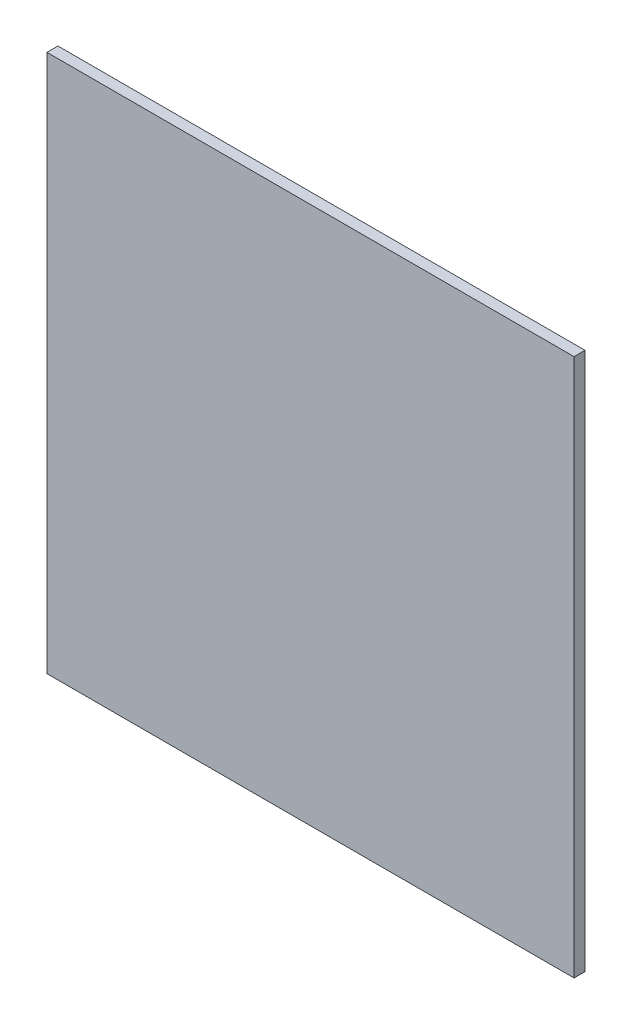
ISO-10303-21;
HEADER;
FILE_DESCRIPTION(('STEP AP214'),'2;1');
FILE_NAME('part.step','',(''),(''),'','','');
FILE_SCHEMA(('AUTOMOTIVE_DESIGN { 1 0 10303 214 1 1 1 1 }'));
ENDSEC;
DATA;
#1=APPLICATION_CONTEXT('core data for automotive mechanical design processes');
#2=APPLICATION_PROTOCOL_DEFINITION('international standard','automotive_design',2000,#1);
#3=PRODUCT_CONTEXT('',#1,'mechanical');
#4=PRODUCT('Part','Part','',(#3));
#5=PRODUCT_RELATED_PRODUCT_CATEGORY('part','',(#4));
#6=PRODUCT_DEFINITION_FORMATION('','',#4);
#7=PRODUCT_DEFINITION_CONTEXT('part definition',#1,'design');
#8=PRODUCT_DEFINITION('design','',#6,#7);
#9=PRODUCT_DEFINITION_SHAPE('','',#8);
#10=(LENGTH_UNIT() NAMED_UNIT(*) SI_UNIT(.MILLI.,.METRE.));
#11=(NAMED_UNIT(*) PLANE_ANGLE_UNIT() SI_UNIT($,.RADIAN.));
#12=(NAMED_UNIT(*) SI_UNIT($,.STERADIAN.) SOLID_ANGLE_UNIT());
#13=UNCERTAINTY_MEASURE_WITH_UNIT(LENGTH_MEASURE(1.E-05),#10,'distance_accuracy_value','');
#14=(GEOMETRIC_REPRESENTATION_CONTEXT(3) GLOBAL_UNCERTAINTY_ASSIGNED_CONTEXT((#13)) GLOBAL_UNIT_ASSIGNED_CONTEXT((#10,
#11,#12)) REPRESENTATION_CONTEXT('',''));
#15=CARTESIAN_POINT('',(0.,0.,0.));
#16=DIRECTION('',(0.,0.,1.));
#17=DIRECTION('',(1.,0.,0.));
#18=AXIS2_PLACEMENT_3D('',#15,#16,#17);
#19=CARTESIAN_POINT('',(0.,0.,5.));
#20=DIRECTION('',(1.,0.,0.));
#21=DIRECTION('',(0.,1.,0.));
#22=AXIS2_PLACEMENT_3D('',#19,#20,#21);
#23=PLANE('',#22);
#24=DIRECTION('',(0.,0.,-1.));
#25=VECTOR('',#24,1.);
#26=CARTESIAN_POINT('',(0.,-245.,5.));
#27=LINE('',#26,#25);
#28=CARTESIAN_POINT('',(0.,-245.,5.));
#29=VERTEX_POINT('',#28);
#30=CARTESIAN_POINT('',(0.,-245.,0.));
#31=VERTEX_POINT('',#30);
#32=EDGE_CURVE('E47',#29,#31,#27,.T.);
#33=ORIENTED_EDGE('',*,*,#32,.F.);
#34=DIRECTION('',(0.,-1.,0.));
#35=VECTOR('',#34,1.);
#36=CARTESIAN_POINT('',(0.,0.,5.));
#37=LINE('',#36,#35);
#38=CARTESIAN_POINT('',(0.,0.,5.));
#39=VERTEX_POINT('',#38);
#40=EDGE_CURVE('E76',#39,#29,#37,.T.);
#41=ORIENTED_EDGE('',*,*,#40,.F.);
#42=DIRECTION('',(0.,0.,-1.));
#43=VECTOR('',#42,1.);
#44=CARTESIAN_POINT('',(0.,0.,5.));
#45=LINE('',#44,#43);
#46=CARTESIAN_POINT('',(0.,0.,0.));
#47=VERTEX_POINT('',#46);
#48=EDGE_CURVE('E40',#39,#47,#45,.T.);
#49=ORIENTED_EDGE('',*,*,#48,.T.);
#50=DIRECTION('',(0.,-1.,0.));
#51=VECTOR('',#50,1.);
#52=CARTESIAN_POINT('',(0.,0.,0.));
#53=LINE('',#52,#51);
#54=EDGE_CURVE('E81',#47,#31,#53,.T.);
#55=ORIENTED_EDGE('',*,*,#54,.T.);
#56=EDGE_LOOP('',(#33,#41,#49,#55));
#57=FACE_BOUND('',#56,.T.);
#58=ADVANCED_FACE('F33',(#57),#23,.F.);
#59=CARTESIAN_POINT('',(240.,0.,5.));
#60=DIRECTION('',(-1.,0.,0.));
#61=DIRECTION('',(0.,-1.,0.));
#62=AXIS2_PLACEMENT_3D('',#59,#60,#61);
#63=PLANE('',#62);
#64=DIRECTION('',(0.,0.,1.));
#65=VECTOR('',#64,1.);
#66=CARTESIAN_POINT('',(240.,-245.,0.));
#67=LINE('',#66,#65);
#68=CARTESIAN_POINT('',(240.,-245.,0.));
#69=VERTEX_POINT('',#68);
#70=CARTESIAN_POINT('',(240.,-245.,5.));
#71=VERTEX_POINT('',#70);
#72=EDGE_CURVE('E87',#69,#71,#67,.T.);
#73=ORIENTED_EDGE('',*,*,#72,.F.);
#74=DIRECTION('',(0.,1.,0.));
#75=VECTOR('',#74,1.);
#76=CARTESIAN_POINT('',(240.,0.,0.));
#77=LINE('',#76,#75);
#78=CARTESIAN_POINT('',(240.,0.,0.));
#79=VERTEX_POINT('',#78);
#80=EDGE_CURVE('E77',#69,#79,#77,.T.);
#81=ORIENTED_EDGE('',*,*,#80,.T.);
#82=DIRECTION('',(0.,0.,-1.));
#83=VECTOR('',#82,1.);
#84=CARTESIAN_POINT('',(240.,0.,5.));
#85=LINE('',#84,#83);
#86=CARTESIAN_POINT('',(240.,0.,5.));
#87=VERTEX_POINT('',#86);
#88=EDGE_CURVE('E11',#87,#79,#85,.T.);
#89=ORIENTED_EDGE('',*,*,#88,.F.);
#90=DIRECTION('',(0.,1.,0.));
#91=VECTOR('',#90,1.);
#92=CARTESIAN_POINT('',(240.,0.,5.));
#93=LINE('',#92,#91);
#94=EDGE_CURVE('E91',#71,#87,#93,.T.);
#95=ORIENTED_EDGE('',*,*,#94,.F.);
#96=EDGE_LOOP('',(#73,#81,#89,#95));
#97=FACE_BOUND('',#96,.T.);
#98=ADVANCED_FACE('F105',(#97),#63,.F.);
#99=CARTESIAN_POINT('',(0.,0.,5.));
#100=DIRECTION('',(0.,0.,1.));
#101=DIRECTION('',(1.,0.,0.));
#102=AXIS2_PLACEMENT_3D('',#99,#100,#101);
#103=PLANE('',#102);
#104=ORIENTED_EDGE('',*,*,#40,.T.);
#105=DIRECTION('',(-1.,0.,0.));
#106=VECTOR('',#105,1.);
#107=CARTESIAN_POINT('',(240.,-245.,5.));
#108=LINE('',#107,#106);
#109=EDGE_CURVE('E84',#71,#29,#108,.T.);
#110=ORIENTED_EDGE('',*,*,#109,.F.);
#111=ORIENTED_EDGE('',*,*,#94,.T.);
#112=DIRECTION('',(-1.,0.,0.));
#113=VECTOR('',#112,1.);
#114=CARTESIAN_POINT('',(0.,0.,5.));
#115=LINE('',#114,#113);
#116=EDGE_CURVE('E56',#87,#39,#115,.T.);
#117=ORIENTED_EDGE('',*,*,#116,.T.);
#118=EDGE_LOOP('',(#104,#110,#111,#117));
#119=FACE_BOUND('',#118,.T.);
#120=ADVANCED_FACE('F107',(#119),#103,.T.);
#121=CARTESIAN_POINT('',(0.,0.,0.));
#122=DIRECTION('',(0.,0.,1.));
#123=DIRECTION('',(1.,0.,0.));
#124=AXIS2_PLACEMENT_3D('',#121,#122,#123);
#125=PLANE('',#124);
#126=DIRECTION('',(1.,0.,0.));
#127=VECTOR('',#126,1.);
#128=CARTESIAN_POINT('',(0.,-245.,0.));
#129=LINE('',#128,#127);
#130=EDGE_CURVE('E83',#31,#69,#129,.T.);
#131=ORIENTED_EDGE('',*,*,#130,.F.);
#132=ORIENTED_EDGE('',*,*,#54,.F.);
#133=DIRECTION('',(-1.,0.,0.));
#134=VECTOR('',#133,1.);
#135=CARTESIAN_POINT('',(0.,0.,0.));
#136=LINE('',#135,#134);
#137=EDGE_CURVE('E68',#79,#47,#136,.T.);
#138=ORIENTED_EDGE('',*,*,#137,.F.);
#139=ORIENTED_EDGE('',*,*,#80,.F.);
#140=EDGE_LOOP('',(#131,#132,#138,#139));
#141=FACE_BOUND('',#140,.T.);
#142=ADVANCED_FACE('F82',(#141),#125,.F.);
#143=CARTESIAN_POINT('',(0.,0.,5.));
#144=DIRECTION('',(0.,-1.,0.));
#145=DIRECTION('',(0.,0.,-1.));
#146=AXIS2_PLACEMENT_3D('',#143,#144,#145);
#147=PLANE('',#146);
#148=ORIENTED_EDGE('',*,*,#137,.T.);
#149=ORIENTED_EDGE('',*,*,#48,.F.);
#150=ORIENTED_EDGE('',*,*,#116,.F.);
#151=ORIENTED_EDGE('',*,*,#88,.T.);
#152=EDGE_LOOP('',(#148,#149,#150,#151));
#153=FACE_BOUND('',#152,.T.);
#154=ADVANCED_FACE('F70',(#153),#147,.F.);
#155=CARTESIAN_POINT('',(0.,-245.,0.));
#156=DIRECTION('',(0.,-1.,0.));
#157=DIRECTION('',(0.,0.,-1.));
#158=AXIS2_PLACEMENT_3D('',#155,#156,#157);
#159=PLANE('',#158);
#160=ORIENTED_EDGE('',*,*,#32,.T.);
#161=ORIENTED_EDGE('',*,*,#130,.T.);
#162=ORIENTED_EDGE('',*,*,#72,.T.);
#163=ORIENTED_EDGE('',*,*,#109,.T.);
#164=EDGE_LOOP('',(#160,#161,#162,#163));
#165=FACE_BOUND('',#164,.T.);
#166=ADVANCED_FACE('F99',(#165),#159,.T.);
#167=CLOSED_SHELL('',(#58,#98,#120,#142,#154,#166));
#168=MANIFOLD_SOLID_BREP('B2',#167);
#169=ADVANCED_BREP_SHAPE_REPRESENTATION('',(#18,#168),#14);
#170=SHAPE_DEFINITION_REPRESENTATION(#9,#169);
ENDSEC;
END-ISO-10303-21;
